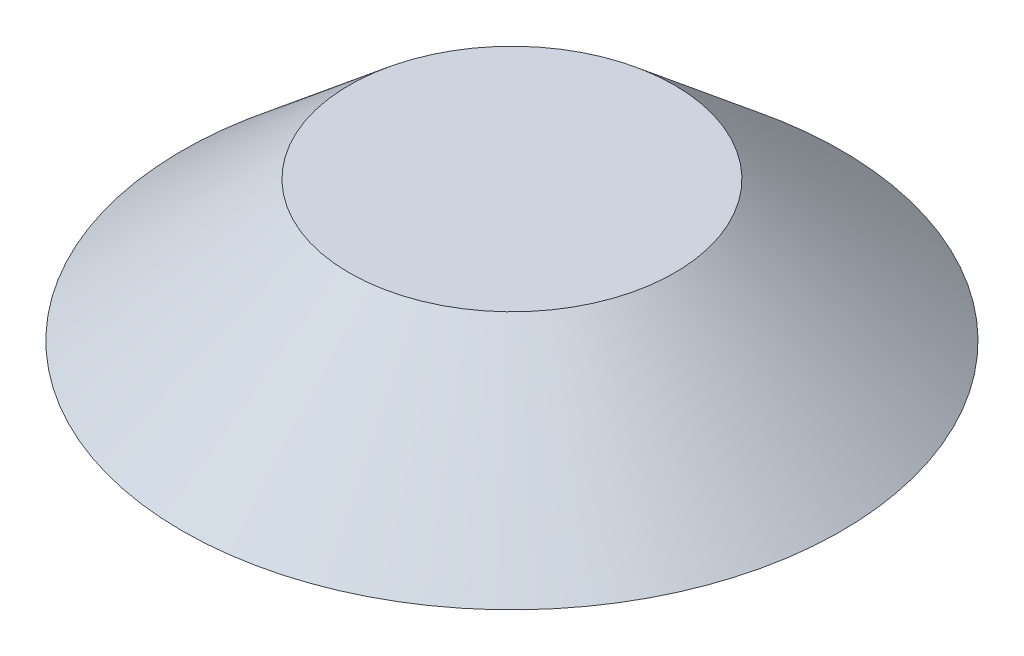
ISO-10303-21;
HEADER;
FILE_DESCRIPTION(('STEP AP214'),'2;1');
FILE_NAME('part.step','',(''),(''),'','','');
FILE_SCHEMA(('AUTOMOTIVE_DESIGN { 1 0 10303 214 1 1 1 1 }'));
ENDSEC;
DATA;
#1=APPLICATION_CONTEXT('core data for automotive mechanical design processes');
#2=APPLICATION_PROTOCOL_DEFINITION('international standard','automotive_design',2000,#1);
#3=PRODUCT_CONTEXT('',#1,'mechanical');
#4=PRODUCT('Part','Part','',(#3));
#5=PRODUCT_RELATED_PRODUCT_CATEGORY('part','',(#4));
#6=PRODUCT_DEFINITION_FORMATION('','',#4);
#7=PRODUCT_DEFINITION_CONTEXT('part definition',#1,'design');
#8=PRODUCT_DEFINITION('design','',#6,#7);
#9=PRODUCT_DEFINITION_SHAPE('','',#8);
#10=(LENGTH_UNIT() NAMED_UNIT(*) SI_UNIT(.MILLI.,.METRE.));
#11=(NAMED_UNIT(*) PLANE_ANGLE_UNIT() SI_UNIT($,.RADIAN.));
#12=(NAMED_UNIT(*) SI_UNIT($,.STERADIAN.) SOLID_ANGLE_UNIT());
#13=UNCERTAINTY_MEASURE_WITH_UNIT(LENGTH_MEASURE(1.E-05),#10,'distance_accuracy_value','');
#14=(GEOMETRIC_REPRESENTATION_CONTEXT(3) GLOBAL_UNCERTAINTY_ASSIGNED_CONTEXT((#13)) GLOBAL_UNIT_ASSIGNED_CONTEXT((#10,
#11,#12)) REPRESENTATION_CONTEXT('',''));
#15=CARTESIAN_POINT('',(0.,0.,0.));
#16=DIRECTION('',(0.,0.,1.));
#17=DIRECTION('',(1.,0.,0.));
#18=AXIS2_PLACEMENT_3D('',#15,#16,#17);
#19=CARTESIAN_POINT('',(-2.413,0.117222218475467,2.413));
#20=DIRECTION('',(0.,1.,0.));
#21=DIRECTION('',(1.,0.,0.));
#22=AXIS2_PLACEMENT_3D('',#19,#20,#21);
#23=PLANE('',#22);
#24=CARTESIAN_POINT('',(0.,0.117222218475467,0.));
#25=DIRECTION('',(0.,1.,0.));
#26=DIRECTION('',(0.,0.,-1.));
#27=AXIS2_PLACEMENT_3D('',#24,#25,#26);
#28=CIRCLE('',#27,2.413);
#29=CARTESIAN_POINT('',(0.,0.117222218475467,-2.413));
#30=VERTEX_POINT('',#29);
#31=EDGE_CURVE('E424',#30,#30,#28,.F.);
#32=ORIENTED_EDGE('',*,*,#31,.F.);
#33=EDGE_LOOP('',(#32));
#34=FACE_BOUND('',#33,.T.);
#35=ADVANCED_FACE('F17',(#34),#23,.T.);
#36=CARTESIAN_POINT('',(-4.8895,-1.96080801813508,-4.8895));
#37=DIRECTION('',(0.,-1.,0.));
#38=DIRECTION('',(1.,0.,0.));
#39=AXIS2_PLACEMENT_3D('',#36,#37,#38);
#40=PLANE('',#39);
#41=CARTESIAN_POINT('',(0.,-1.96080801813508,0.));
#42=DIRECTION('',(0.,-1.,0.));
#43=DIRECTION('',(0.,0.,1.));
#44=AXIS2_PLACEMENT_3D('',#41,#42,#43);
#45=CIRCLE('',#44,4.8895);
#46=CARTESIAN_POINT('',(0.,-1.96080801813508,4.8895));
#47=VERTEX_POINT('',#46);
#48=EDGE_CURVE('E150',#47,#47,#45,.T.);
#49=ORIENTED_EDGE('',*,*,#48,.T.);
#50=EDGE_LOOP('',(#49));
#51=FACE_BOUND('',#50,.T.);
#52=DIRECTION('',(0.,0.,-1.));
#53=VECTOR('',#52,1.);
#54=CARTESIAN_POINT('',(2.58826,-1.96080801813508,0.528320000000001));
#55=LINE('',#54,#53);
#56=CARTESIAN_POINT('',(2.58826,-1.96080801813508,0.528320000000001));
#57=VERTEX_POINT('',#56);
#58=CARTESIAN_POINT('',(2.58826,-1.96080801813508,-0.52832));
#59=VERTEX_POINT('',#58);
#60=EDGE_CURVE('E132',#57,#59,#55,.T.);
#61=ORIENTED_EDGE('',*,*,#60,.T.);
#62=DIRECTION('',(-1.,0.,0.));
#63=VECTOR('',#62,1.);
#64=CARTESIAN_POINT('',(2.58826,-1.96080801813508,-0.52832));
#65=LINE('',#64,#63);
#66=CARTESIAN_POINT('',(0.78232,-1.96080801813508,-0.52832));
#67=VERTEX_POINT('',#66);
#68=EDGE_CURVE('E145',#67,#59,#65,.F.);
#69=ORIENTED_EDGE('',*,*,#68,.F.);
#70=CARTESIAN_POINT('',(0.782320000000041,-1.96080801813508,-0.782320000000041));
#71=DIRECTION('',(0.,-1.,0.));
#72=DIRECTION('',(-1.59977018508953E-13,0.,1.));
#73=AXIS2_PLACEMENT_3D('',#70,#71,#72);
#74=CIRCLE('',#73,0.254000000000041);
#75=CARTESIAN_POINT('',(0.52832,-1.96080801813508,-0.78232));
#76=VERTEX_POINT('',#75);
#77=EDGE_CURVE('E155',#67,#76,#74,.T.);
#78=ORIENTED_EDGE('',*,*,#77,.T.);
#79=DIRECTION('',(0.,0.,-1.));
#80=VECTOR('',#79,1.);
#81=CARTESIAN_POINT('',(0.528320000000001,-1.96080801813508,-0.78232));
#82=LINE('',#81,#80);
#83=CARTESIAN_POINT('',(0.528320000000001,-1.96080801813508,-2.58826));
#84=VERTEX_POINT('',#83);
#85=EDGE_CURVE('E157',#84,#76,#82,.F.);
#86=ORIENTED_EDGE('',*,*,#85,.F.);
#87=DIRECTION('',(-1.,0.,0.));
#88=VECTOR('',#87,1.);
#89=CARTESIAN_POINT('',(0.528320000000001,-1.96080801813508,-2.58826));
#90=LINE('',#89,#88);
#91=CARTESIAN_POINT('',(-0.52832,-1.96080801813508,-2.58826));
#92=VERTEX_POINT('',#91);
#93=EDGE_CURVE('E168',#92,#84,#90,.F.);
#94=ORIENTED_EDGE('',*,*,#93,.F.);
#95=DIRECTION('',(0.,0.,1.));
#96=VECTOR('',#95,1.);
#97=CARTESIAN_POINT('',(-0.52832,-1.96080801813508,-2.58826));
#98=LINE('',#97,#96);
#99=CARTESIAN_POINT('',(-0.52832,-1.96080801813508,-0.782320000000015));
#100=VERTEX_POINT('',#99);
#101=EDGE_CURVE('E173',#100,#92,#98,.F.);
#102=ORIENTED_EDGE('',*,*,#101,.F.);
#103=CARTESIAN_POINT('',(-0.782320000000041,-1.96080801813508,-0.782320000000041));
#104=DIRECTION('',(0.,-1.,0.));
#105=DIRECTION('',(1.,0.,1.32002895053836E-13));
#106=AXIS2_PLACEMENT_3D('',#103,#104,#105);
#107=CIRCLE('',#106,0.254000000000041);
#108=CARTESIAN_POINT('',(-0.78232,-1.96080801813508,-0.52832));
#109=VERTEX_POINT('',#108);
#110=EDGE_CURVE('E178',#100,#109,#107,.T.);
#111=ORIENTED_EDGE('',*,*,#110,.T.);
#112=DIRECTION('',(-1.,0.,0.));
#113=VECTOR('',#112,1.);
#114=CARTESIAN_POINT('',(-0.78232,-1.96080801813508,-0.52832));
#115=LINE('',#114,#113);
#116=CARTESIAN_POINT('',(-2.58826,-1.96080801813508,-0.52832));
#117=VERTEX_POINT('',#116);
#118=EDGE_CURVE('E183',#117,#109,#115,.F.);
#119=ORIENTED_EDGE('',*,*,#118,.F.);
#120=DIRECTION('',(0.,0.,1.));
#121=VECTOR('',#120,1.);
#122=CARTESIAN_POINT('',(-2.58826,-1.96080801813508,-0.52832));
#123=LINE('',#122,#121);
#124=CARTESIAN_POINT('',(-2.58826,-1.96080801813508,0.528320000000001));
#125=VERTEX_POINT('',#124);
#126=EDGE_CURVE('E188',#125,#117,#123,.F.);
#127=ORIENTED_EDGE('',*,*,#126,.F.);
#128=DIRECTION('',(1.,0.,0.));
#129=VECTOR('',#128,1.);
#130=CARTESIAN_POINT('',(-2.58826,-1.96080801813508,0.528320000000001));
#131=LINE('',#130,#129);
#132=CARTESIAN_POINT('',(-0.78232,-1.96080801813508,0.528320000000001));
#133=VERTEX_POINT('',#132);
#134=EDGE_CURVE('E193',#133,#125,#131,.F.);
#135=ORIENTED_EDGE('',*,*,#134,.F.);
#136=CARTESIAN_POINT('',(-0.782320000000041,-1.96080801813508,0.782320000000041));
#137=DIRECTION('',(0.,-1.,0.));
#138=DIRECTION('',(1.59977018508954E-13,0.,-1.));
#139=AXIS2_PLACEMENT_3D('',#136,#137,#138);
#140=CIRCLE('',#139,0.254000000000041);
#141=CARTESIAN_POINT('',(-0.52832,-1.96080801813508,0.782320000000008));
#142=VERTEX_POINT('',#141);
#143=EDGE_CURVE('E198',#133,#142,#140,.T.);
#144=ORIENTED_EDGE('',*,*,#143,.T.);
#145=DIRECTION('',(0.,0.,1.));
#146=VECTOR('',#145,1.);
#147=CARTESIAN_POINT('',(-0.52832,-1.96080801813508,0.78232));
#148=LINE('',#147,#146);
#149=CARTESIAN_POINT('',(-0.52832,-1.96080801813508,2.58826));
#150=VERTEX_POINT('',#149);
#151=EDGE_CURVE('E203',#150,#142,#148,.F.);
#152=ORIENTED_EDGE('',*,*,#151,.F.);
#153=DIRECTION('',(1.,0.,0.));
#154=VECTOR('',#153,1.);
#155=CARTESIAN_POINT('',(-0.52832,-1.96080801813508,2.58826));
#156=LINE('',#155,#154);
#157=CARTESIAN_POINT('',(0.528320000000001,-1.96080801813508,2.58826));
#158=VERTEX_POINT('',#157);
#159=EDGE_CURVE('E208',#158,#150,#156,.F.);
#160=ORIENTED_EDGE('',*,*,#159,.F.);
#161=DIRECTION('',(0.,0.,-1.));
#162=VECTOR('',#161,1.);
#163=CARTESIAN_POINT('',(0.528320000000001,-1.96080801813508,2.58826));
#164=LINE('',#163,#162);
#165=CARTESIAN_POINT('',(0.528320000000001,-1.96080801813508,0.78232));
#166=VERTEX_POINT('',#165);
#167=EDGE_CURVE('E213',#166,#158,#164,.F.);
#168=ORIENTED_EDGE('',*,*,#167,.F.);
#169=CARTESIAN_POINT('',(0.782320000000041,-1.96080801813508,0.782320000000041));
#170=DIRECTION('',(0.,-1.,0.));
#171=DIRECTION('',(-1.,0.,-1.59977018508954E-13));
#172=AXIS2_PLACEMENT_3D('',#169,#170,#171);
#173=CIRCLE('',#172,0.254000000000041);
#174=CARTESIAN_POINT('',(0.782320000000022,-1.96080801813508,0.52832));
#175=VERTEX_POINT('',#174);
#176=EDGE_CURVE('E218',#166,#175,#173,.T.);
#177=ORIENTED_EDGE('',*,*,#176,.T.);
#178=DIRECTION('',(1.,0.,0.));
#179=VECTOR('',#178,1.);
#180=CARTESIAN_POINT('',(0.782320000000022,-1.96080801813508,0.528320000000001));
#181=LINE('',#180,#179);
#182=EDGE_CURVE('E149',#57,#175,#181,.F.);
#183=ORIENTED_EDGE('',*,*,#182,.F.);
#184=EDGE_LOOP('',(#61,#69,#78,#86,#94,#102,#111,#119,#127,#135,#144,#152,#160,#168,#177,#183));
#185=FACE_BOUND('',#184,.T.);
#186=ADVANCED_FACE('F143',(#51,#185),#40,.T.);
#187=CARTESIAN_POINT('',(-2.58826,-1.96080801813508,0.52832));
#188=DIRECTION('',(0.,0.,-1.));
#189=DIRECTION('',(0.,1.,0.));
#190=AXIS2_PLACEMENT_3D('',#187,#188,#189);
#191=PLANE('',#190);
#192=ORIENTED_EDGE('',*,*,#134,.T.);
#193=DIRECTION('',(0.,1.,0.));
#194=VECTOR('',#193,1.);
#195=CARTESIAN_POINT('',(-2.58826,-1.96080801813508,0.52832));
#196=LINE('',#195,#194);
#197=CARTESIAN_POINT('',(-2.58826,-1.04132801813507,0.52832));
#198=VERTEX_POINT('',#197);
#199=EDGE_CURVE('E225',#198,#125,#196,.F.);
#200=ORIENTED_EDGE('',*,*,#199,.F.);
#201=DIRECTION('',(1.,0.,0.));
#202=VECTOR('',#201,1.);
#203=CARTESIAN_POINT('',(-2.58826,-1.04132801813507,0.52832));
#204=LINE('',#203,#202);
#205=CARTESIAN_POINT('',(-0.78232,-1.04132801813507,0.52832));
#206=VERTEX_POINT('',#205);
#207=EDGE_CURVE('E229',#206,#198,#204,.F.);
#208=ORIENTED_EDGE('',*,*,#207,.F.);
#209=DIRECTION('',(0.,-1.,0.));
#210=VECTOR('',#209,1.);
#211=CARTESIAN_POINT('',(-0.78232,-1.04132801813507,0.52832));
#212=LINE('',#211,#210);
#213=EDGE_CURVE('E233',#206,#133,#212,.T.);
#214=ORIENTED_EDGE('',*,*,#213,.T.);
#215=EDGE_LOOP('',(#192,#200,#208,#214));
#216=FACE_BOUND('',#215,.T.);
#217=ADVANCED_FACE('F405',(#216),#191,.T.);
#218=CARTESIAN_POINT('',(-2.58826,-1.96080801813508,-0.52832));
#219=DIRECTION('',(1.,0.,0.));
#220=DIRECTION('',(0.,1.,0.));
#221=AXIS2_PLACEMENT_3D('',#218,#219,#220);
#222=PLANE('',#221);
#223=ORIENTED_EDGE('',*,*,#126,.T.);
#224=DIRECTION('',(0.,1.,0.));
#225=VECTOR('',#224,1.);
#226=CARTESIAN_POINT('',(-2.58826,-1.96080801813508,-0.52832));
#227=LINE('',#226,#225);
#228=CARTESIAN_POINT('',(-2.58826,-1.04132801813507,-0.52832));
#229=VERTEX_POINT('',#228);
#230=EDGE_CURVE('E238',#229,#117,#227,.F.);
#231=ORIENTED_EDGE('',*,*,#230,.F.);
#232=DIRECTION('',(0.,0.,1.));
#233=VECTOR('',#232,1.);
#234=CARTESIAN_POINT('',(-2.58826,-1.04132801813507,-0.52832));
#235=LINE('',#234,#233);
#236=EDGE_CURVE('E242',#198,#229,#235,.F.);
#237=ORIENTED_EDGE('',*,*,#236,.F.);
#238=ORIENTED_EDGE('',*,*,#199,.T.);
#239=EDGE_LOOP('',(#223,#231,#237,#238));
#240=FACE_BOUND('',#239,.T.);
#241=ADVANCED_FACE('F402',(#240),#222,.T.);
#242=CARTESIAN_POINT('',(-0.78232,-1.96080801813508,-0.52832));
#243=DIRECTION('',(0.,0.,1.));
#244=DIRECTION('',(0.,1.,0.));
#245=AXIS2_PLACEMENT_3D('',#242,#243,#244);
#246=PLANE('',#245);
#247=ORIENTED_EDGE('',*,*,#118,.T.);
#248=DIRECTION('',(0.,1.,0.));
#249=VECTOR('',#248,1.);
#250=CARTESIAN_POINT('',(-0.78232,-1.96080801813508,-0.52832));
#251=LINE('',#250,#249);
#252=CARTESIAN_POINT('',(-0.78232,-1.04132801813507,-0.52832));
#253=VERTEX_POINT('',#252);
#254=EDGE_CURVE('E246',#253,#109,#251,.F.);
#255=ORIENTED_EDGE('',*,*,#254,.F.);
#256=DIRECTION('',(-1.,0.,0.));
#257=VECTOR('',#256,1.);
#258=CARTESIAN_POINT('',(-0.78232,-1.04132801813507,-0.52832));
#259=LINE('',#258,#257);
#260=EDGE_CURVE('E250',#229,#253,#259,.F.);
#261=ORIENTED_EDGE('',*,*,#260,.F.);
#262=ORIENTED_EDGE('',*,*,#230,.T.);
#263=EDGE_LOOP('',(#247,#255,#261,#262));
#264=FACE_BOUND('',#263,.T.);
#265=ADVANCED_FACE('F397',(#264),#246,.T.);
#266=CARTESIAN_POINT('',(-0.782320000000041,-1.04132801813507,-0.782320000000041));
#267=DIRECTION('',(0.,-1.,0.));
#268=DIRECTION('',(1.,0.,0.));
#269=AXIS2_PLACEMENT_3D('',#266,#267,#268);
#270=CYLINDRICAL_SURFACE('',#269,0.254000000000041);
#271=ORIENTED_EDGE('',*,*,#110,.F.);
#272=DIRECTION('',(0.,1.,0.));
#273=VECTOR('',#272,1.);
#274=CARTESIAN_POINT('',(-0.52832,-1.96080801813508,-0.782320000000011));
#275=LINE('',#274,#273);
#276=CARTESIAN_POINT('',(-0.52832,-1.04132801813507,-0.78232000000001));
#277=VERTEX_POINT('',#276);
#278=EDGE_CURVE('E254',#277,#100,#275,.F.);
#279=ORIENTED_EDGE('',*,*,#278,.F.);
#280=CARTESIAN_POINT('',(-0.782320000000041,-1.04132801813507,-0.782320000000041));
#281=DIRECTION('',(0.,-1.,0.));
#282=DIRECTION('',(1.,0.,1.20638407400194E-13));
#283=AXIS2_PLACEMENT_3D('',#280,#281,#282);
#284=CIRCLE('',#283,0.254000000000041);
#285=EDGE_CURVE('E258',#277,#253,#284,.T.);
#286=ORIENTED_EDGE('',*,*,#285,.T.);
#287=ORIENTED_EDGE('',*,*,#254,.T.);
#288=EDGE_LOOP('',(#271,#279,#286,#287));
#289=FACE_BOUND('',#288,.T.);
#290=ADVANCED_FACE('F393',(#289),#270,.T.);
#291=CARTESIAN_POINT('',(-0.52832,-1.96080801813508,-2.58826));
#292=DIRECTION('',(1.,0.,0.));
#293=DIRECTION('',(0.,1.,0.));
#294=AXIS2_PLACEMENT_3D('',#291,#292,#293);
#295=PLANE('',#294);
#296=ORIENTED_EDGE('',*,*,#101,.T.);
#297=DIRECTION('',(0.,1.,0.));
#298=VECTOR('',#297,1.);
#299=CARTESIAN_POINT('',(-0.52832,-1.96080801813508,-2.58826));
#300=LINE('',#299,#298);
#301=CARTESIAN_POINT('',(-0.52832,-1.04132801813507,-2.58826));
#302=VERTEX_POINT('',#301);
#303=EDGE_CURVE('E263',#302,#92,#300,.F.);
#304=ORIENTED_EDGE('',*,*,#303,.F.);
#305=DIRECTION('',(0.,0.,1.));
#306=VECTOR('',#305,1.);
#307=CARTESIAN_POINT('',(-0.52832,-1.04132801813507,-2.58826));
#308=LINE('',#307,#306);
#309=EDGE_CURVE('E267',#277,#302,#308,.F.);
#310=ORIENTED_EDGE('',*,*,#309,.F.);
#311=ORIENTED_EDGE('',*,*,#278,.T.);
#312=EDGE_LOOP('',(#296,#304,#310,#311));
#313=FACE_BOUND('',#312,.T.);
#314=ADVANCED_FACE('F389',(#313),#295,.T.);
#315=CARTESIAN_POINT('',(0.52832,-1.96080801813508,-2.58826));
#316=DIRECTION('',(0.,0.,1.));
#317=DIRECTION('',(0.,1.,0.));
#318=AXIS2_PLACEMENT_3D('',#315,#316,#317);
#319=PLANE('',#318);
#320=ORIENTED_EDGE('',*,*,#93,.T.);
#321=DIRECTION('',(0.,1.,0.));
#322=VECTOR('',#321,1.);
#323=CARTESIAN_POINT('',(0.52832,-1.96080801813508,-2.58826));
#324=LINE('',#323,#322);
#325=CARTESIAN_POINT('',(0.52832,-1.04132801813507,-2.58826));
#326=VERTEX_POINT('',#325);
#327=EDGE_CURVE('E271',#326,#84,#324,.F.);
#328=ORIENTED_EDGE('',*,*,#327,.F.);
#329=DIRECTION('',(-1.,0.,0.));
#330=VECTOR('',#329,1.);
#331=CARTESIAN_POINT('',(0.52832,-1.04132801813507,-2.58826));
#332=LINE('',#331,#330);
#333=EDGE_CURVE('E275',#302,#326,#332,.F.);
#334=ORIENTED_EDGE('',*,*,#333,.F.);
#335=ORIENTED_EDGE('',*,*,#303,.T.);
#336=EDGE_LOOP('',(#320,#328,#334,#335));
#337=FACE_BOUND('',#336,.T.);
#338=ADVANCED_FACE('F384',(#337),#319,.T.);
#339=CARTESIAN_POINT('',(0.52832,-1.96080801813508,-0.78232));
#340=DIRECTION('',(-1.,0.,0.));
#341=DIRECTION('',(0.,1.,0.));
#342=AXIS2_PLACEMENT_3D('',#339,#340,#341);
#343=PLANE('',#342);
#344=ORIENTED_EDGE('',*,*,#85,.T.);
#345=DIRECTION('',(0.,1.,0.));
#346=VECTOR('',#345,1.);
#347=CARTESIAN_POINT('',(0.52832,-1.96080801813508,-0.78232));
#348=LINE('',#347,#346);
#349=CARTESIAN_POINT('',(0.52832,-1.04132801813507,-0.78232));
#350=VERTEX_POINT('',#349);
#351=EDGE_CURVE('E279',#350,#76,#348,.F.);
#352=ORIENTED_EDGE('',*,*,#351,.F.);
#353=DIRECTION('',(0.,0.,-1.));
#354=VECTOR('',#353,1.);
#355=CARTESIAN_POINT('',(0.52832,-1.04132801813507,-0.78232));
#356=LINE('',#355,#354);
#357=EDGE_CURVE('E283',#326,#350,#356,.F.);
#358=ORIENTED_EDGE('',*,*,#357,.F.);
#359=ORIENTED_EDGE('',*,*,#327,.T.);
#360=EDGE_LOOP('',(#344,#352,#358,#359));
#361=FACE_BOUND('',#360,.T.);
#362=ADVANCED_FACE('F379',(#361),#343,.T.);
#363=CARTESIAN_POINT('',(0.782320000000041,-1.04132801813507,-0.782320000000041));
#364=DIRECTION('',(0.,-1.,0.));
#365=DIRECTION('',(-1.61081918495658E-13,0.,1.));
#366=AXIS2_PLACEMENT_3D('',#363,#364,#365);
#367=CYLINDRICAL_SURFACE('',#366,0.254000000000041);
#368=ORIENTED_EDGE('',*,*,#77,.F.);
#369=DIRECTION('',(0.,1.,0.));
#370=VECTOR('',#369,1.);
#371=CARTESIAN_POINT('',(0.78232,-1.96080801813508,-0.52832));
#372=LINE('',#371,#370);
#373=CARTESIAN_POINT('',(0.78232,-1.04132801813507,-0.52832));
#374=VERTEX_POINT('',#373);
#375=EDGE_CURVE('E154',#374,#67,#372,.F.);
#376=ORIENTED_EDGE('',*,*,#375,.F.);
#377=CARTESIAN_POINT('',(0.782320000000041,-1.04132801813507,-0.782320000000041));
#378=DIRECTION('',(0.,-1.,0.));
#379=DIRECTION('',(-1.61288305545912E-13,0.,1.));
#380=AXIS2_PLACEMENT_3D('',#377,#378,#379);
#381=CIRCLE('',#380,0.254000000000041);
#382=EDGE_CURVE('E138',#374,#350,#381,.T.);
#383=ORIENTED_EDGE('',*,*,#382,.T.);
#384=ORIENTED_EDGE('',*,*,#351,.T.);
#385=EDGE_LOOP('',(#368,#376,#383,#384));
#386=FACE_BOUND('',#385,.T.);
#387=ADVANCED_FACE('F374',(#386),#367,.T.);
#388=CARTESIAN_POINT('',(2.58826,-1.96080801813508,-0.52832));
#389=DIRECTION('',(0.,0.,1.));
#390=DIRECTION('',(0.,1.,0.));
#391=AXIS2_PLACEMENT_3D('',#388,#389,#390);
#392=PLANE('',#391);
#393=ORIENTED_EDGE('',*,*,#68,.T.);
#394=DIRECTION('',(0.,1.,0.));
#395=VECTOR('',#394,1.);
#396=CARTESIAN_POINT('',(2.58826,-1.96080801813508,-0.52832));
#397=LINE('',#396,#395);
#398=CARTESIAN_POINT('',(2.58826,-1.04132801813507,-0.52832));
#399=VERTEX_POINT('',#398);
#400=EDGE_CURVE('E128',#399,#59,#397,.F.);
#401=ORIENTED_EDGE('',*,*,#400,.F.);
#402=DIRECTION('',(-1.,0.,0.));
#403=VECTOR('',#402,1.);
#404=CARTESIAN_POINT('',(2.58826,-1.04132801813507,-0.52832));
#405=LINE('',#404,#403);
#406=EDGE_CURVE('E137',#374,#399,#405,.F.);
#407=ORIENTED_EDGE('',*,*,#406,.F.);
#408=ORIENTED_EDGE('',*,*,#375,.T.);
#409=EDGE_LOOP('',(#393,#401,#407,#408));
#410=FACE_BOUND('',#409,.T.);
#411=ADVANCED_FACE('F152',(#410),#392,.T.);
#412=CARTESIAN_POINT('',(2.58826,-1.96080801813508,0.52832));
#413=DIRECTION('',(-1.,0.,0.));
#414=DIRECTION('',(0.,1.,0.));
#415=AXIS2_PLACEMENT_3D('',#412,#413,#414);
#416=PLANE('',#415);
#417=ORIENTED_EDGE('',*,*,#400,.T.);
#418=ORIENTED_EDGE('',*,*,#60,.F.);
#419=DIRECTION('',(0.,1.,0.));
#420=VECTOR('',#419,1.);
#421=CARTESIAN_POINT('',(2.58826,-1.96080801813508,0.52832));
#422=LINE('',#421,#420);
#423=CARTESIAN_POINT('',(2.58826,-1.04132801813507,0.52832));
#424=VERTEX_POINT('',#423);
#425=EDGE_CURVE('E299',#424,#57,#422,.F.);
#426=ORIENTED_EDGE('',*,*,#425,.F.);
#427=DIRECTION('',(0.,0.,-1.));
#428=VECTOR('',#427,1.);
#429=CARTESIAN_POINT('',(2.58826,-1.04132801813507,0.52832));
#430=LINE('',#429,#428);
#431=EDGE_CURVE('E133',#399,#424,#430,.F.);
#432=ORIENTED_EDGE('',*,*,#431,.F.);
#433=EDGE_LOOP('',(#417,#418,#426,#432));
#434=FACE_BOUND('',#433,.T.);
#435=ADVANCED_FACE('F130',(#434),#416,.T.);
#436=CARTESIAN_POINT('',(0.78232,-1.96080801813508,0.52832));
#437=DIRECTION('',(0.,0.,-1.));
#438=DIRECTION('',(0.,1.,0.));
#439=AXIS2_PLACEMENT_3D('',#436,#437,#438);
#440=PLANE('',#439);
#441=ORIENTED_EDGE('',*,*,#182,.T.);
#442=DIRECTION('',(0.,1.,0.));
#443=VECTOR('',#442,1.);
#444=CARTESIAN_POINT('',(0.782320000000021,-1.96080801813508,0.52832));
#445=LINE('',#444,#443);
#446=CARTESIAN_POINT('',(0.78232000000002,-1.04132801813507,0.52832));
#447=VERTEX_POINT('',#446);
#448=EDGE_CURVE('E306',#447,#175,#445,.F.);
#449=ORIENTED_EDGE('',*,*,#448,.F.);
#450=DIRECTION('',(1.,0.,0.));
#451=VECTOR('',#450,1.);
#452=CARTESIAN_POINT('',(0.78232000000002,-1.04132801813507,0.52832));
#453=LINE('',#452,#451);
#454=EDGE_CURVE('E310',#424,#447,#453,.F.);
#455=ORIENTED_EDGE('',*,*,#454,.F.);
#456=ORIENTED_EDGE('',*,*,#425,.T.);
#457=EDGE_LOOP('',(#441,#449,#455,#456));
#458=FACE_BOUND('',#457,.T.);
#459=ADVANCED_FACE('F370',(#458),#440,.T.);
#460=CARTESIAN_POINT('',(0.782320000000041,-1.04132801813507,0.782320000000041));
#461=DIRECTION('',(0.,-1.,0.));
#462=DIRECTION('',(-1.,0.,-1.5968841852615E-13));
#463=AXIS2_PLACEMENT_3D('',#460,#461,#462);
#464=CYLINDRICAL_SURFACE('',#463,0.254000000000041);
#465=ORIENTED_EDGE('',*,*,#176,.F.);
#466=DIRECTION('',(0.,1.,0.));
#467=VECTOR('',#466,1.);
#468=CARTESIAN_POINT('',(0.52832,-1.96080801813508,0.782320000000001));
#469=LINE('',#468,#467);
#470=CARTESIAN_POINT('',(0.52832,-1.04132801813507,0.78232));
#471=VERTEX_POINT('',#470);
#472=EDGE_CURVE('E314',#471,#166,#469,.F.);
#473=ORIENTED_EDGE('',*,*,#472,.F.);
#474=CARTESIAN_POINT('',(0.782320000000041,-1.04132801813507,0.782320000000041));
#475=DIRECTION('',(0.,-1.,0.));
#476=DIRECTION('',(-1.,0.,-1.61288305545912E-13));
#477=AXIS2_PLACEMENT_3D('',#474,#475,#476);
#478=CIRCLE('',#477,0.254000000000041);
#479=EDGE_CURVE('E318',#471,#447,#478,.T.);
#480=ORIENTED_EDGE('',*,*,#479,.T.);
#481=ORIENTED_EDGE('',*,*,#448,.T.);
#482=EDGE_LOOP('',(#465,#473,#480,#481));
#483=FACE_BOUND('',#482,.T.);
#484=ADVANCED_FACE('F367',(#483),#464,.T.);
#485=CARTESIAN_POINT('',(0.52832,-1.96080801813508,2.58826));
#486=DIRECTION('',(-1.,0.,0.));
#487=DIRECTION('',(0.,1.,0.));
#488=AXIS2_PLACEMENT_3D('',#485,#486,#487);
#489=PLANE('',#488);
#490=ORIENTED_EDGE('',*,*,#167,.T.);
#491=DIRECTION('',(0.,1.,0.));
#492=VECTOR('',#491,1.);
#493=CARTESIAN_POINT('',(0.52832,-1.96080801813508,2.58826));
#494=LINE('',#493,#492);
#495=CARTESIAN_POINT('',(0.52832,-1.04132801813507,2.58826));
#496=VERTEX_POINT('',#495);
#497=EDGE_CURVE('E323',#496,#158,#494,.F.);
#498=ORIENTED_EDGE('',*,*,#497,.F.);
#499=DIRECTION('',(0.,0.,-1.));
#500=VECTOR('',#499,1.);
#501=CARTESIAN_POINT('',(0.52832,-1.04132801813507,2.58826));
#502=LINE('',#501,#500);
#503=EDGE_CURVE('E327',#471,#496,#502,.F.);
#504=ORIENTED_EDGE('',*,*,#503,.F.);
#505=ORIENTED_EDGE('',*,*,#472,.T.);
#506=EDGE_LOOP('',(#490,#498,#504,#505));
#507=FACE_BOUND('',#506,.T.);
#508=ADVANCED_FACE('F363',(#507),#489,.T.);
#509=CARTESIAN_POINT('',(-0.52832,-1.96080801813508,2.58826));
#510=DIRECTION('',(0.,0.,-1.));
#511=DIRECTION('',(0.,1.,0.));
#512=AXIS2_PLACEMENT_3D('',#509,#510,#511);
#513=PLANE('',#512);
#514=ORIENTED_EDGE('',*,*,#159,.T.);
#515=DIRECTION('',(0.,1.,0.));
#516=VECTOR('',#515,1.);
#517=CARTESIAN_POINT('',(-0.52832,-1.96080801813508,2.58826));
#518=LINE('',#517,#516);
#519=CARTESIAN_POINT('',(-0.52832,-1.04132801813507,2.58826));
#520=VERTEX_POINT('',#519);
#521=EDGE_CURVE('E331',#520,#150,#518,.F.);
#522=ORIENTED_EDGE('',*,*,#521,.F.);
#523=DIRECTION('',(1.,0.,0.));
#524=VECTOR('',#523,1.);
#525=CARTESIAN_POINT('',(-0.52832,-1.04132801813507,2.58826));
#526=LINE('',#525,#524);
#527=EDGE_CURVE('E36',#496,#520,#526,.F.);
#528=ORIENTED_EDGE('',*,*,#527,.F.);
#529=ORIENTED_EDGE('',*,*,#497,.T.);
#530=EDGE_LOOP('',(#514,#522,#528,#529));
#531=FACE_BOUND('',#530,.T.);
#532=ADVANCED_FACE('F358',(#531),#513,.T.);
#533=CARTESIAN_POINT('',(-0.52832,-1.96080801813508,0.78232));
#534=DIRECTION('',(1.,0.,0.));
#535=DIRECTION('',(0.,1.,0.));
#536=AXIS2_PLACEMENT_3D('',#533,#534,#535);
#537=PLANE('',#536);
#538=ORIENTED_EDGE('',*,*,#151,.T.);
#539=DIRECTION('',(0.,1.,0.));
#540=VECTOR('',#539,1.);
#541=CARTESIAN_POINT('',(-0.52832,-1.96080801813508,0.782320000000005));
#542=LINE('',#541,#540);
#543=CARTESIAN_POINT('',(-0.52832,-1.04132801813507,0.78232000000001));
#544=VERTEX_POINT('',#543);
#545=EDGE_CURVE('E338',#544,#142,#542,.F.);
#546=ORIENTED_EDGE('',*,*,#545,.F.);
#547=DIRECTION('',(0.,0.,1.));
#548=VECTOR('',#547,1.);
#549=CARTESIAN_POINT('',(-0.52832,-1.04132801813507,0.78232000000001));
#550=LINE('',#549,#548);
#551=EDGE_CURVE('E26',#520,#544,#550,.F.);
#552=ORIENTED_EDGE('',*,*,#551,.F.);
#553=ORIENTED_EDGE('',*,*,#521,.T.);
#554=EDGE_LOOP('',(#538,#546,#552,#553));
#555=FACE_BOUND('',#554,.T.);
#556=ADVANCED_FACE('F355',(#555),#537,.T.);
#557=CARTESIAN_POINT('',(-0.782320000000041,-1.04132801813507,0.782320000000041));
#558=DIRECTION('',(0.,-1.,0.));
#559=DIRECTION('',(0.,0.,-1.));
#560=AXIS2_PLACEMENT_3D('',#557,#558,#559);
#561=CYLINDRICAL_SURFACE('',#560,0.254000000000041);
#562=ORIENTED_EDGE('',*,*,#143,.F.);
#563=ORIENTED_EDGE('',*,*,#213,.F.);
#564=CARTESIAN_POINT('',(-0.782320000000041,-1.04132801813507,0.782320000000041));
#565=DIRECTION('',(0.,-1.,0.));
#566=DIRECTION('',(1.59977018508953E-13,0.,-1.));
#567=AXIS2_PLACEMENT_3D('',#564,#565,#566);
#568=CIRCLE('',#567,0.254000000000041);
#569=EDGE_CURVE('E11',#206,#544,#568,.T.);
#570=ORIENTED_EDGE('',*,*,#569,.T.);
#571=ORIENTED_EDGE('',*,*,#545,.T.);
#572=EDGE_LOOP('',(#562,#563,#570,#571));
#573=FACE_BOUND('',#572,.T.);
#574=ADVANCED_FACE('F348',(#573),#561,.T.);
#575=CARTESIAN_POINT('',(-2.58826,-1.04132801813507,2.58826));
#576=DIRECTION('',(0.,-1.,0.));
#577=DIRECTION('',(0.,0.,-1.));
#578=AXIS2_PLACEMENT_3D('',#575,#576,#577);
#579=PLANE('',#578);
#580=ORIENTED_EDGE('',*,*,#207,.T.);
#581=ORIENTED_EDGE('',*,*,#236,.T.);
#582=ORIENTED_EDGE('',*,*,#260,.T.);
#583=ORIENTED_EDGE('',*,*,#285,.F.);
#584=ORIENTED_EDGE('',*,*,#309,.T.);
#585=ORIENTED_EDGE('',*,*,#333,.T.);
#586=ORIENTED_EDGE('',*,*,#357,.T.);
#587=ORIENTED_EDGE('',*,*,#382,.F.);
#588=ORIENTED_EDGE('',*,*,#406,.T.);
#589=ORIENTED_EDGE('',*,*,#431,.T.);
#590=ORIENTED_EDGE('',*,*,#454,.T.);
#591=ORIENTED_EDGE('',*,*,#479,.F.);
#592=ORIENTED_EDGE('',*,*,#503,.T.);
#593=ORIENTED_EDGE('',*,*,#527,.T.);
#594=ORIENTED_EDGE('',*,*,#551,.T.);
#595=ORIENTED_EDGE('',*,*,#569,.F.);
#596=EDGE_LOOP('',(#580,#581,#582,#583,#584,#585,#586,#587,#588,#589,#590,#591,#592,#593,#594,#595));
#597=FACE_BOUND('',#596,.T.);
#598=ADVANCED_FACE('F372',(#597),#579,.T.);
#599=CARTESIAN_POINT('',(0.,-1.96080801813508,0.));
#600=DIRECTION('',(0.,-1.,0.));
#601=DIRECTION('',(0.,0.,1.));
#602=AXIS2_PLACEMENT_3D('',#599,#600,#601);
#603=CONICAL_SURFACE('',#602,4.8895,0.872664625997163);
#604=ORIENTED_EDGE('',*,*,#48,.F.);
#605=EDGE_LOOP('',(#604));
#606=FACE_BOUND('',#605,.T.);
#607=ORIENTED_EDGE('',*,*,#31,.T.);
#608=EDGE_LOOP('',(#607));
#609=FACE_BOUND('',#608,.T.);
#610=ADVANCED_FACE('F19',(#606,#609),#603,.T.);
#611=CLOSED_SHELL('',(#35,#186,#217,#241,#265,#290,#314,#338,#362,#387,#411,#435,#459,#484,#508,
#532,#556,#574,#598,#610));
#612=MANIFOLD_SOLID_BREP('B1',#611);
#613=ADVANCED_BREP_SHAPE_REPRESENTATION('',(#18,#612),#14);
#614=SHAPE_DEFINITION_REPRESENTATION(#9,#613);
ENDSEC;
END-ISO-10303-21;
